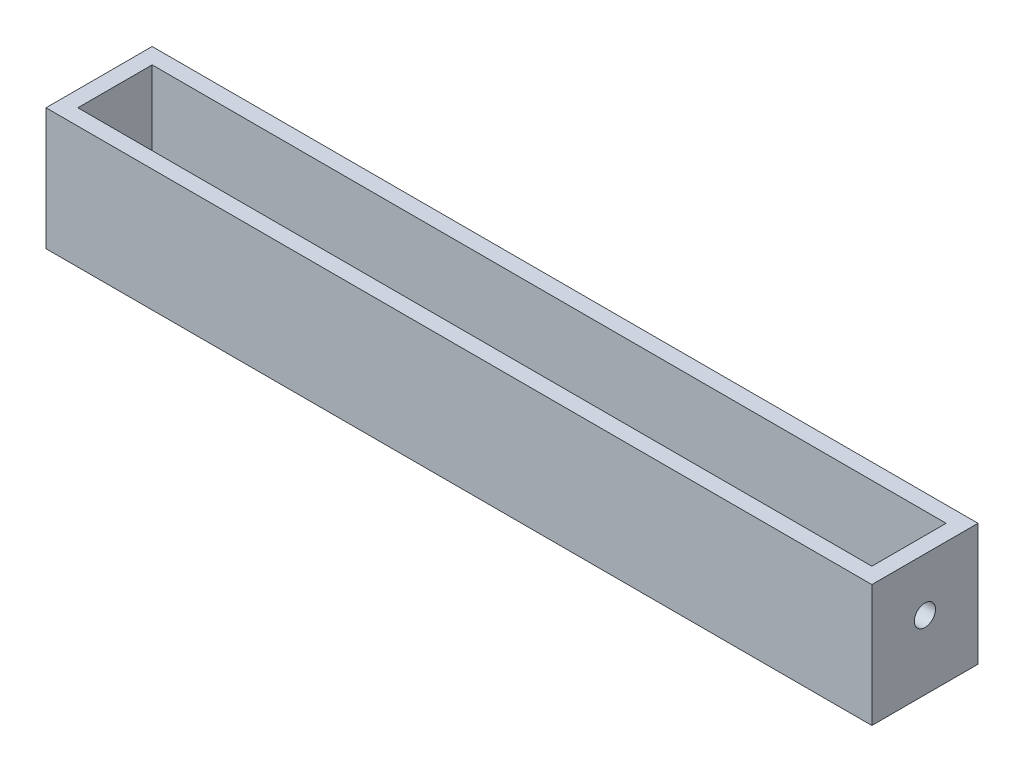
ISO-10303-21;
HEADER;
FILE_DESCRIPTION(('STEP AP214'),'2;1');
FILE_NAME('part.step','',(''),(''),'','','');
FILE_SCHEMA(('AUTOMOTIVE_DESIGN { 1 0 10303 214 1 1 1 1 }'));
ENDSEC;
DATA;
#1=APPLICATION_CONTEXT('core data for automotive mechanical design processes');
#2=APPLICATION_PROTOCOL_DEFINITION('international standard','automotive_design',2000,#1);
#3=PRODUCT_CONTEXT('',#1,'mechanical');
#4=PRODUCT('Part','Part','',(#3));
#5=PRODUCT_RELATED_PRODUCT_CATEGORY('part','',(#4));
#6=PRODUCT_DEFINITION_FORMATION('','',#4);
#7=PRODUCT_DEFINITION_CONTEXT('part definition',#1,'design');
#8=PRODUCT_DEFINITION('design','',#6,#7);
#9=PRODUCT_DEFINITION_SHAPE('','',#8);
#10=(LENGTH_UNIT() NAMED_UNIT(*) SI_UNIT(.MILLI.,.METRE.));
#11=(NAMED_UNIT(*) PLANE_ANGLE_UNIT() SI_UNIT($,.RADIAN.));
#12=(NAMED_UNIT(*) SI_UNIT($,.STERADIAN.) SOLID_ANGLE_UNIT());
#13=UNCERTAINTY_MEASURE_WITH_UNIT(LENGTH_MEASURE(1.E-05),#10,'distance_accuracy_value','');
#14=(GEOMETRIC_REPRESENTATION_CONTEXT(3) GLOBAL_UNCERTAINTY_ASSIGNED_CONTEXT((#13)) GLOBAL_UNIT_ASSIGNED_CONTEXT((#10,
#11,#12)) REPRESENTATION_CONTEXT('',''));
#15=CARTESIAN_POINT('',(0.,0.,0.));
#16=DIRECTION('',(0.,0.,1.));
#17=DIRECTION('',(1.,0.,0.));
#18=AXIS2_PLACEMENT_3D('',#15,#16,#17);
#19=CARTESIAN_POINT('',(0.,3.,0.));
#20=DIRECTION('',(0.,1.,0.));
#21=DIRECTION('',(0.,0.,1.));
#22=AXIS2_PLACEMENT_3D('',#19,#20,#21);
#23=PLANE('',#22);
#24=CARTESIAN_POINT('',(-37.5,3.,0.));
#25=DIRECTION('',(0.,1.,0.));
#26=DIRECTION('',(0.,0.,1.));
#27=AXIS2_PLACEMENT_3D('',#24,#25,#26);
#28=CIRCLE('',#27,4.);
#29=CARTESIAN_POINT('',(-37.5,3.,4.));
#30=VERTEX_POINT('',#29);
#31=EDGE_CURVE('E182',#30,#30,#28,.T.);
#32=ORIENTED_EDGE('',*,*,#31,.F.);
#33=EDGE_LOOP('',(#32));
#34=FACE_BOUND('',#33,.T.);
#35=CARTESIAN_POINT('',(37.5,3.,0.));
#36=DIRECTION('',(0.,1.,0.));
#37=DIRECTION('',(0.,0.,1.));
#38=AXIS2_PLACEMENT_3D('',#35,#36,#37);
#39=CIRCLE('',#38,4.);
#40=CARTESIAN_POINT('',(37.5,3.,4.));
#41=VERTEX_POINT('',#40);
#42=EDGE_CURVE('E178',#41,#41,#39,.T.);
#43=ORIENTED_EDGE('',*,*,#42,.F.);
#44=EDGE_LOOP('',(#43));
#45=FACE_BOUND('',#44,.T.);
#46=DIRECTION('',(1.,0.,0.));
#47=VECTOR('',#46,1.);
#48=CARTESIAN_POINT('',(0.,3.,7.));
#49=LINE('',#48,#47);
#50=CARTESIAN_POINT('',(-74.8,3.,7.));
#51=VERTEX_POINT('',#50);
#52=CARTESIAN_POINT('',(74.8,3.,7.));
#53=VERTEX_POINT('',#52);
#54=EDGE_CURVE('E160',#51,#53,#49,.T.);
#55=ORIENTED_EDGE('',*,*,#54,.T.);
#56=DIRECTION('',(0.,0.,-1.));
#57=VECTOR('',#56,1.);
#58=CARTESIAN_POINT('',(74.8,3.,0.));
#59=LINE('',#58,#57);
#60=CARTESIAN_POINT('',(74.8,3.,-7.));
#61=VERTEX_POINT('',#60);
#62=EDGE_CURVE('E58',#53,#61,#59,.T.);
#63=ORIENTED_EDGE('',*,*,#62,.T.);
#64=DIRECTION('',(1.,0.,0.));
#65=VECTOR('',#64,1.);
#66=CARTESIAN_POINT('',(0.,3.,-7.));
#67=LINE('',#66,#65);
#68=CARTESIAN_POINT('',(-74.8,3.,-7.));
#69=VERTEX_POINT('',#68);
#70=EDGE_CURVE('E128',#69,#61,#67,.T.);
#71=ORIENTED_EDGE('',*,*,#70,.F.);
#72=DIRECTION('',(0.,0.,-1.));
#73=VECTOR('',#72,1.);
#74=CARTESIAN_POINT('',(-74.8,3.,0.));
#75=LINE('',#74,#73);
#76=EDGE_CURVE('E164',#51,#69,#75,.T.);
#77=ORIENTED_EDGE('',*,*,#76,.F.);
#78=EDGE_LOOP('',(#55,#63,#71,#77));
#79=FACE_BOUND('',#78,.T.);
#80=ADVANCED_FACE('F41',(#34,#45,#79),#23,.T.);
#81=CARTESIAN_POINT('',(0.,3.,9.99999999999997));
#82=DIRECTION('',(0.,0.,-1.));
#83=DIRECTION('',(-1.,0.,0.));
#84=AXIS2_PLACEMENT_3D('',#81,#82,#83);
#85=PLANE('',#84);
#86=DIRECTION('',(1.,0.,0.));
#87=VECTOR('',#86,1.);
#88=CARTESIAN_POINT('',(0.,0.,9.99999999999997));
#89=LINE('',#88,#87);
#90=CARTESIAN_POINT('',(-77.8000000000001,0.,9.99999999999996));
#91=VERTEX_POINT('',#90);
#92=CARTESIAN_POINT('',(77.7999999999999,0.,9.99999999999997));
#93=VERTEX_POINT('',#92);
#94=EDGE_CURVE('E194',#91,#93,#89,.T.);
#95=ORIENTED_EDGE('',*,*,#94,.T.);
#96=DIRECTION('',(0.,-1.,0.));
#97=VECTOR('',#96,1.);
#98=CARTESIAN_POINT('',(77.7999999999999,3.,9.99999999999997));
#99=LINE('',#98,#97);
#100=CARTESIAN_POINT('',(77.8,23.,9.99999999999997));
#101=VERTEX_POINT('',#100);
#102=EDGE_CURVE('E11',#101,#93,#99,.T.);
#103=ORIENTED_EDGE('',*,*,#102,.F.);
#104=DIRECTION('',(1.,0.,0.));
#105=VECTOR('',#104,1.);
#106=CARTESIAN_POINT('',(0.,23.,9.99999999999997));
#107=LINE('',#106,#105);
#108=CARTESIAN_POINT('',(-77.8000000000001,23.,9.99999999999996));
#109=VERTEX_POINT('',#108);
#110=EDGE_CURVE('E145',#109,#101,#107,.T.);
#111=ORIENTED_EDGE('',*,*,#110,.F.);
#112=DIRECTION('',(0.,-1.,0.));
#113=VECTOR('',#112,1.);
#114=CARTESIAN_POINT('',(-77.8000000000001,3.,9.99999999999996));
#115=LINE('',#114,#113);
#116=EDGE_CURVE('E66',#109,#91,#115,.T.);
#117=ORIENTED_EDGE('',*,*,#116,.T.);
#118=EDGE_LOOP('',(#95,#103,#111,#117));
#119=FACE_BOUND('',#118,.T.);
#120=ADVANCED_FACE('F227',(#119),#85,.F.);
#121=CARTESIAN_POINT('',(77.7999999999999,3.,0.));
#122=DIRECTION('',(-1.,0.,0.));
#123=DIRECTION('',(0.,0.,1.));
#124=AXIS2_PLACEMENT_3D('',#121,#122,#123);
#125=PLANE('',#124);
#126=CARTESIAN_POINT('',(77.7999999999999,13.,0.));
#127=DIRECTION('',(-1.,0.,0.));
#128=DIRECTION('',(0.,0.,1.));
#129=AXIS2_PLACEMENT_3D('',#126,#127,#128);
#130=CIRCLE('',#129,2.);
#131=CARTESIAN_POINT('',(77.7999999999999,13.,2.));
#132=VERTEX_POINT('',#131);
#133=EDGE_CURVE('E161',#132,#132,#130,.T.);
#134=ORIENTED_EDGE('',*,*,#133,.T.);
#135=EDGE_LOOP('',(#134));
#136=FACE_BOUND('',#135,.T.);
#137=DIRECTION('',(0.,0.,-1.));
#138=VECTOR('',#137,1.);
#139=CARTESIAN_POINT('',(77.7999999999999,0.,0.));
#140=LINE('',#139,#138);
#141=CARTESIAN_POINT('',(77.7999999999999,0.,-10.));
#142=VERTEX_POINT('',#141);
#143=EDGE_CURVE('E197',#93,#142,#140,.T.);
#144=ORIENTED_EDGE('',*,*,#143,.T.);
#145=DIRECTION('',(0.,-1.,0.));
#146=VECTOR('',#145,1.);
#147=CARTESIAN_POINT('',(77.7999999999999,3.,-10.));
#148=LINE('',#147,#146);
#149=CARTESIAN_POINT('',(77.7999999999999,23.,-10.));
#150=VERTEX_POINT('',#149);
#151=EDGE_CURVE('E51',#150,#142,#148,.T.);
#152=ORIENTED_EDGE('',*,*,#151,.F.);
#153=DIRECTION('',(0.,0.,-1.));
#154=VECTOR('',#153,1.);
#155=CARTESIAN_POINT('',(77.7999999999999,23.,0.));
#156=LINE('',#155,#154);
#157=EDGE_CURVE('E149',#101,#150,#156,.T.);
#158=ORIENTED_EDGE('',*,*,#157,.F.);
#159=ORIENTED_EDGE('',*,*,#102,.T.);
#160=EDGE_LOOP('',(#144,#152,#158,#159));
#161=FACE_BOUND('',#160,.T.);
#162=ADVANCED_FACE('F220',(#136,#161),#125,.F.);
#163=CARTESIAN_POINT('',(0.,3.,-10.));
#164=DIRECTION('',(0.,0.,-1.));
#165=DIRECTION('',(-1.,0.,0.));
#166=AXIS2_PLACEMENT_3D('',#163,#164,#165);
#167=PLANE('',#166);
#168=DIRECTION('',(1.,0.,0.));
#169=VECTOR('',#168,1.);
#170=CARTESIAN_POINT('',(0.,0.,-10.));
#171=LINE('',#170,#169);
#172=CARTESIAN_POINT('',(-77.8000000000001,0.,-9.99999999999996));
#173=VERTEX_POINT('',#172);
#174=EDGE_CURVE('E201',#173,#142,#171,.T.);
#175=ORIENTED_EDGE('',*,*,#174,.F.);
#176=DIRECTION('',(0.,-1.,0.));
#177=VECTOR('',#176,1.);
#178=CARTESIAN_POINT('',(-77.8000000000001,3.,-9.99999999999996));
#179=LINE('',#178,#177);
#180=CARTESIAN_POINT('',(-77.8000000000001,23.,-9.99999999999996));
#181=VERTEX_POINT('',#180);
#182=EDGE_CURVE('E210',#181,#173,#179,.T.);
#183=ORIENTED_EDGE('',*,*,#182,.F.);
#184=DIRECTION('',(-1.,0.,0.));
#185=VECTOR('',#184,1.);
#186=CARTESIAN_POINT('',(0.,23.,-10.));
#187=LINE('',#186,#185);
#188=EDGE_CURVE('E153',#150,#181,#187,.T.);
#189=ORIENTED_EDGE('',*,*,#188,.F.);
#190=ORIENTED_EDGE('',*,*,#151,.T.);
#191=EDGE_LOOP('',(#175,#183,#189,#190));
#192=FACE_BOUND('',#191,.T.);
#193=ADVANCED_FACE('F217',(#192),#167,.T.);
#194=CARTESIAN_POINT('',(-37.5,3.,0.));
#195=DIRECTION('',(0.,-1.,0.));
#196=DIRECTION('',(0.,0.,-1.));
#197=AXIS2_PLACEMENT_3D('',#194,#195,#196);
#198=CYLINDRICAL_SURFACE('',#197,4.);
#199=ORIENTED_EDGE('',*,*,#31,.T.);
#200=EDGE_LOOP('',(#199));
#201=FACE_BOUND('',#200,.T.);
#202=CARTESIAN_POINT('',(-37.5,0.,0.));
#203=DIRECTION('',(0.,1.,0.));
#204=DIRECTION('',(0.,0.,1.));
#205=AXIS2_PLACEMENT_3D('',#202,#203,#204);
#206=CIRCLE('',#205,4.);
#207=CARTESIAN_POINT('',(-37.5,0.,4.));
#208=VERTEX_POINT('',#207);
#209=EDGE_CURVE('E190',#208,#208,#206,.T.);
#210=ORIENTED_EDGE('',*,*,#209,.F.);
#211=EDGE_LOOP('',(#210));
#212=FACE_BOUND('',#211,.T.);
#213=ADVANCED_FACE('F239',(#201,#212),#198,.F.);
#214=CARTESIAN_POINT('',(37.5,3.,0.));
#215=DIRECTION('',(0.,-1.,0.));
#216=DIRECTION('',(0.,0.,-1.));
#217=AXIS2_PLACEMENT_3D('',#214,#215,#216);
#218=CYLINDRICAL_SURFACE('',#217,4.);
#219=ORIENTED_EDGE('',*,*,#42,.T.);
#220=EDGE_LOOP('',(#219));
#221=FACE_BOUND('',#220,.T.);
#222=CARTESIAN_POINT('',(37.5,0.,0.));
#223=DIRECTION('',(0.,1.,0.));
#224=DIRECTION('',(0.,0.,1.));
#225=AXIS2_PLACEMENT_3D('',#222,#223,#224);
#226=CIRCLE('',#225,4.);
#227=CARTESIAN_POINT('',(37.5,0.,4.));
#228=VERTEX_POINT('',#227);
#229=EDGE_CURVE('E116',#228,#228,#226,.T.);
#230=ORIENTED_EDGE('',*,*,#229,.F.);
#231=EDGE_LOOP('',(#230));
#232=FACE_BOUND('',#231,.T.);
#233=ADVANCED_FACE('F43',(#221,#232),#218,.F.);
#234=CARTESIAN_POINT('',(-77.8000000000001,3.,0.));
#235=DIRECTION('',(-1.,0.,0.));
#236=DIRECTION('',(0.,0.,1.));
#237=AXIS2_PLACEMENT_3D('',#234,#235,#236);
#238=PLANE('',#237);
#239=CARTESIAN_POINT('',(-77.8000000000001,13.,0.));
#240=DIRECTION('',(-1.,0.,0.));
#241=DIRECTION('',(0.,0.,1.));
#242=AXIS2_PLACEMENT_3D('',#239,#240,#241);
#243=CIRCLE('',#242,2.);
#244=CARTESIAN_POINT('',(-77.8000000000001,13.,2.));
#245=VERTEX_POINT('',#244);
#246=EDGE_CURVE('E293',#245,#245,#243,.T.);
#247=ORIENTED_EDGE('',*,*,#246,.F.);
#248=EDGE_LOOP('',(#247));
#249=FACE_BOUND('',#248,.T.);
#250=DIRECTION('',(0.,0.,-1.));
#251=VECTOR('',#250,1.);
#252=CARTESIAN_POINT('',(-77.8000000000001,0.,0.));
#253=LINE('',#252,#251);
#254=EDGE_CURVE('E183',#91,#173,#253,.T.);
#255=ORIENTED_EDGE('',*,*,#254,.F.);
#256=ORIENTED_EDGE('',*,*,#116,.F.);
#257=DIRECTION('',(0.,0.,1.));
#258=VECTOR('',#257,1.);
#259=CARTESIAN_POINT('',(-77.8000000000001,23.,0.));
#260=LINE('',#259,#258);
#261=EDGE_CURVE('E141',#181,#109,#260,.T.);
#262=ORIENTED_EDGE('',*,*,#261,.F.);
#263=ORIENTED_EDGE('',*,*,#182,.T.);
#264=EDGE_LOOP('',(#255,#256,#262,#263));
#265=FACE_BOUND('',#264,.T.);
#266=ADVANCED_FACE('F225',(#249,#265),#238,.T.);
#267=CARTESIAN_POINT('',(0.,0.,0.));
#268=DIRECTION('',(0.,1.,0.));
#269=DIRECTION('',(0.,0.,1.));
#270=AXIS2_PLACEMENT_3D('',#267,#268,#269);
#271=PLANE('',#270);
#272=ORIENTED_EDGE('',*,*,#229,.T.);
#273=EDGE_LOOP('',(#272));
#274=FACE_BOUND('',#273,.T.);
#275=ORIENTED_EDGE('',*,*,#209,.T.);
#276=EDGE_LOOP('',(#275));
#277=FACE_BOUND('',#276,.T.);
#278=ORIENTED_EDGE('',*,*,#94,.F.);
#279=ORIENTED_EDGE('',*,*,#254,.T.);
#280=ORIENTED_EDGE('',*,*,#174,.T.);
#281=ORIENTED_EDGE('',*,*,#143,.F.);
#282=EDGE_LOOP('',(#278,#279,#280,#281));
#283=FACE_BOUND('',#282,.T.);
#284=ADVANCED_FACE('F222',(#274,#277,#283),#271,.F.);
#285=CARTESIAN_POINT('',(74.8,23.,0.));
#286=DIRECTION('',(-1.,0.,0.));
#287=DIRECTION('',(0.,0.,1.));
#288=AXIS2_PLACEMENT_3D('',#285,#286,#287);
#289=PLANE('',#288);
#290=CARTESIAN_POINT('',(74.8,13.,0.));
#291=DIRECTION('',(-1.,0.,0.));
#292=DIRECTION('',(0.,0.,1.));
#293=AXIS2_PLACEMENT_3D('',#290,#291,#292);
#294=CIRCLE('',#293,2.);
#295=CARTESIAN_POINT('',(74.8,13.,2.));
#296=VERTEX_POINT('',#295);
#297=EDGE_CURVE('E286',#296,#296,#294,.T.);
#298=ORIENTED_EDGE('',*,*,#297,.F.);
#299=EDGE_LOOP('',(#298));
#300=FACE_BOUND('',#299,.T.);
#301=ORIENTED_EDGE('',*,*,#62,.F.);
#302=DIRECTION('',(0.,-1.,0.));
#303=VECTOR('',#302,1.);
#304=CARTESIAN_POINT('',(74.8,23.,7.));
#305=LINE('',#304,#303);
#306=CARTESIAN_POINT('',(74.8,23.,7.));
#307=VERTEX_POINT('',#306);
#308=EDGE_CURVE('E107',#307,#53,#305,.T.);
#309=ORIENTED_EDGE('',*,*,#308,.F.);
#310=DIRECTION('',(0.,0.,-1.));
#311=VECTOR('',#310,1.);
#312=CARTESIAN_POINT('',(74.8,23.,0.));
#313=LINE('',#312,#311);
#314=CARTESIAN_POINT('',(74.8,23.,-7.));
#315=VERTEX_POINT('',#314);
#316=EDGE_CURVE('E110',#307,#315,#313,.T.);
#317=ORIENTED_EDGE('',*,*,#316,.T.);
#318=DIRECTION('',(0.,-1.,0.));
#319=VECTOR('',#318,1.);
#320=CARTESIAN_POINT('',(74.8,23.,-7.));
#321=LINE('',#320,#319);
#322=EDGE_CURVE('E157',#315,#61,#321,.T.);
#323=ORIENTED_EDGE('',*,*,#322,.T.);
#324=EDGE_LOOP('',(#301,#309,#317,#323));
#325=FACE_BOUND('',#324,.T.);
#326=ADVANCED_FACE('F109',(#300,#325),#289,.T.);
#327=CARTESIAN_POINT('',(0.,23.,7.));
#328=DIRECTION('',(0.,0.,-1.));
#329=DIRECTION('',(-1.,0.,0.));
#330=AXIS2_PLACEMENT_3D('',#327,#328,#329);
#331=PLANE('',#330);
#332=ORIENTED_EDGE('',*,*,#54,.F.);
#333=DIRECTION('',(0.,-1.,0.));
#334=VECTOR('',#333,1.);
#335=CARTESIAN_POINT('',(-74.8,23.,7.));
#336=LINE('',#335,#334);
#337=CARTESIAN_POINT('',(-74.8,23.,7.));
#338=VERTEX_POINT('',#337);
#339=EDGE_CURVE('E117',#338,#51,#336,.T.);
#340=ORIENTED_EDGE('',*,*,#339,.F.);
#341=DIRECTION('',(1.,0.,0.));
#342=VECTOR('',#341,1.);
#343=CARTESIAN_POINT('',(0.,23.,7.));
#344=LINE('',#343,#342);
#345=EDGE_CURVE('E123',#338,#307,#344,.T.);
#346=ORIENTED_EDGE('',*,*,#345,.T.);
#347=ORIENTED_EDGE('',*,*,#308,.T.);
#348=EDGE_LOOP('',(#332,#340,#346,#347));
#349=FACE_BOUND('',#348,.T.);
#350=ADVANCED_FACE('F130',(#349),#331,.T.);
#351=CARTESIAN_POINT('',(-74.8,23.,0.));
#352=DIRECTION('',(-1.,0.,0.));
#353=DIRECTION('',(0.,0.,1.));
#354=AXIS2_PLACEMENT_3D('',#351,#352,#353);
#355=PLANE('',#354);
#356=CARTESIAN_POINT('',(-74.8,13.,0.));
#357=DIRECTION('',(-1.,0.,0.));
#358=DIRECTION('',(0.,0.,1.));
#359=AXIS2_PLACEMENT_3D('',#356,#357,#358);
#360=CIRCLE('',#359,2.);
#361=CARTESIAN_POINT('',(-74.8,13.,2.));
#362=VERTEX_POINT('',#361);
#363=EDGE_CURVE('E45',#362,#362,#360,.T.);
#364=ORIENTED_EDGE('',*,*,#363,.T.);
#365=EDGE_LOOP('',(#364));
#366=FACE_BOUND('',#365,.T.);
#367=ORIENTED_EDGE('',*,*,#76,.T.);
#368=DIRECTION('',(0.,-1.,0.));
#369=VECTOR('',#368,1.);
#370=CARTESIAN_POINT('',(-74.8,23.,-7.));
#371=LINE('',#370,#369);
#372=CARTESIAN_POINT('',(-74.8,23.,-7.));
#373=VERTEX_POINT('',#372);
#374=EDGE_CURVE('E172',#373,#69,#371,.T.);
#375=ORIENTED_EDGE('',*,*,#374,.F.);
#376=DIRECTION('',(0.,0.,-1.));
#377=VECTOR('',#376,1.);
#378=CARTESIAN_POINT('',(-74.8,23.,0.));
#379=LINE('',#378,#377);
#380=EDGE_CURVE('E133',#338,#373,#379,.T.);
#381=ORIENTED_EDGE('',*,*,#380,.F.);
#382=ORIENTED_EDGE('',*,*,#339,.T.);
#383=EDGE_LOOP('',(#367,#375,#381,#382));
#384=FACE_BOUND('',#383,.T.);
#385=ADVANCED_FACE('F265',(#366,#384),#355,.F.);
#386=CARTESIAN_POINT('',(0.,23.,-7.));
#387=DIRECTION('',(0.,0.,-1.));
#388=DIRECTION('',(-1.,0.,0.));
#389=AXIS2_PLACEMENT_3D('',#386,#387,#388);
#390=PLANE('',#389);
#391=ORIENTED_EDGE('',*,*,#70,.T.);
#392=ORIENTED_EDGE('',*,*,#322,.F.);
#393=DIRECTION('',(1.,0.,0.));
#394=VECTOR('',#393,1.);
#395=CARTESIAN_POINT('',(0.,23.,-7.));
#396=LINE('',#395,#394);
#397=EDGE_CURVE('E125',#373,#315,#396,.T.);
#398=ORIENTED_EDGE('',*,*,#397,.F.);
#399=ORIENTED_EDGE('',*,*,#374,.T.);
#400=EDGE_LOOP('',(#391,#392,#398,#399));
#401=FACE_BOUND('',#400,.T.);
#402=ADVANCED_FACE('F268',(#401),#390,.F.);
#403=CARTESIAN_POINT('',(0.,23.,0.));
#404=DIRECTION('',(0.,1.,0.));
#405=DIRECTION('',(0.,0.,1.));
#406=AXIS2_PLACEMENT_3D('',#403,#404,#405);
#407=PLANE('',#406);
#408=ORIENTED_EDGE('',*,*,#316,.F.);
#409=ORIENTED_EDGE('',*,*,#345,.F.);
#410=ORIENTED_EDGE('',*,*,#380,.T.);
#411=ORIENTED_EDGE('',*,*,#397,.T.);
#412=EDGE_LOOP('',(#408,#409,#410,#411));
#413=FACE_BOUND('',#412,.T.);
#414=ORIENTED_EDGE('',*,*,#261,.T.);
#415=ORIENTED_EDGE('',*,*,#110,.T.);
#416=ORIENTED_EDGE('',*,*,#157,.T.);
#417=ORIENTED_EDGE('',*,*,#188,.T.);
#418=EDGE_LOOP('',(#414,#415,#416,#417));
#419=FACE_BOUND('',#418,.T.);
#420=ADVANCED_FACE('F121',(#413,#419),#407,.T.);
#421=CARTESIAN_POINT('',(82.2,13.,0.));
#422=DIRECTION('',(-1.,0.,0.));
#423=DIRECTION('',(0.,0.,1.));
#424=AXIS2_PLACEMENT_3D('',#421,#422,#423);
#425=CYLINDRICAL_SURFACE('',#424,2.);
#426=ORIENTED_EDGE('',*,*,#246,.T.);
#427=EDGE_LOOP('',(#426));
#428=FACE_BOUND('',#427,.T.);
#429=ORIENTED_EDGE('',*,*,#363,.F.);
#430=EDGE_LOOP('',(#429));
#431=FACE_BOUND('',#430,.T.);
#432=ADVANCED_FACE('F275',(#428,#431),#425,.F.);
#433=ORIENTED_EDGE('',*,*,#297,.T.);
#434=EDGE_LOOP('',(#433));
#435=FACE_BOUND('',#434,.T.);
#436=ORIENTED_EDGE('',*,*,#133,.F.);
#437=EDGE_LOOP('',(#436));
#438=FACE_BOUND('',#437,.T.);
#439=ADVANCED_FACE('F276',(#435,#438),#425,.F.);
#440=CLOSED_SHELL('',(#80,#120,#162,#193,#213,#233,#266,#284,#326,#350,#385,#402,#420,#432,#439));
#441=MANIFOLD_SOLID_BREP('B2',#440);
#442=ADVANCED_BREP_SHAPE_REPRESENTATION('',(#18,#441),#14);
#443=SHAPE_DEFINITION_REPRESENTATION(#9,#442);
ENDSEC;
END-ISO-10303-21;
